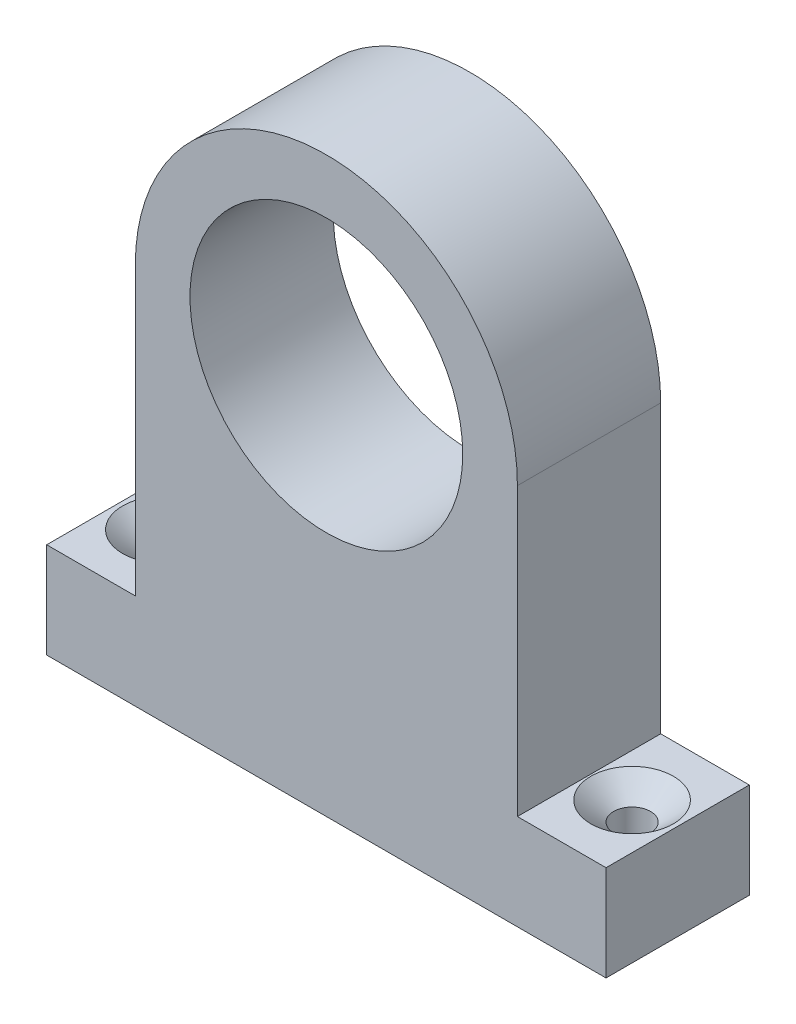
ISO-10303-21;
HEADER;
FILE_DESCRIPTION(('STEP AP214'),'2;1');
FILE_NAME('part.step','',(''),(''),'','','');
FILE_SCHEMA(('AUTOMOTIVE_DESIGN { 1 0 10303 214 1 1 1 1 }'));
ENDSEC;
DATA;
#1=APPLICATION_CONTEXT('core data for automotive mechanical design processes');
#2=APPLICATION_PROTOCOL_DEFINITION('international standard','automotive_design',2000,#1);
#3=PRODUCT_CONTEXT('',#1,'mechanical');
#4=PRODUCT('Part','Part','',(#3));
#5=PRODUCT_RELATED_PRODUCT_CATEGORY('part','',(#4));
#6=PRODUCT_DEFINITION_FORMATION('','',#4);
#7=PRODUCT_DEFINITION_CONTEXT('part definition',#1,'design');
#8=PRODUCT_DEFINITION('design','',#6,#7);
#9=PRODUCT_DEFINITION_SHAPE('','',#8);
#10=(LENGTH_UNIT() NAMED_UNIT(*) SI_UNIT(.MILLI.,.METRE.));
#11=(NAMED_UNIT(*) PLANE_ANGLE_UNIT() SI_UNIT($,.RADIAN.));
#12=(NAMED_UNIT(*) SI_UNIT($,.STERADIAN.) SOLID_ANGLE_UNIT());
#13=UNCERTAINTY_MEASURE_WITH_UNIT(LENGTH_MEASURE(1.E-05),#10,'distance_accuracy_value','');
#14=(GEOMETRIC_REPRESENTATION_CONTEXT(3) GLOBAL_UNCERTAINTY_ASSIGNED_CONTEXT((#13)) GLOBAL_UNIT_ASSIGNED_CONTEXT((#10,
#11,#12)) REPRESENTATION_CONTEXT('',''));
#15=CARTESIAN_POINT('',(0.,0.,0.));
#16=DIRECTION('',(0.,0.,1.));
#17=DIRECTION('',(1.,0.,0.));
#18=AXIS2_PLACEMENT_3D('',#15,#16,#17);
#19=CARTESIAN_POINT('',(-37.1816,95.25,97.5106));
#20=DIRECTION('',(0.,0.,-1.));
#21=DIRECTION('',(-1.,0.,0.));
#22=AXIS2_PLACEMENT_3D('',#19,#20,#21);
#23=PLANE('',#22);
#24=CARTESIAN_POINT('',(0.,69.8500000000001,97.5106));
#25=DIRECTION('',(0.,0.,1.));
#26=DIRECTION('',(1.,0.,0.));
#27=AXIS2_PLACEMENT_3D('',#24,#25,#26);
#28=CIRCLE('',#27,18.1316);
#29=CARTESIAN_POINT('',(18.1316000000001,69.8500000000001,97.5106));
#30=VERTEX_POINT('',#29);
#31=EDGE_CURVE('E197',#30,#30,#28,.T.);
#32=ORIENTED_EDGE('',*,*,#31,.F.);
#33=EDGE_LOOP('',(#32));
#34=FACE_BOUND('',#33,.T.);
#35=CARTESIAN_POINT('',(0.,69.8500000000001,97.5106));
#36=DIRECTION('',(0.,0.,1.));
#37=DIRECTION('',(1.,0.,0.));
#38=AXIS2_PLACEMENT_3D('',#35,#36,#37);
#39=CIRCLE('',#38,25.3999999999999);
#40=CARTESIAN_POINT('',(25.3999999999999,69.8500000000002,97.5106));
#41=VERTEX_POINT('',#40);
#42=CARTESIAN_POINT('',(-25.3999999999998,69.8500000000001,97.5106));
#43=VERTEX_POINT('',#42);
#44=EDGE_CURVE('E173',#41,#43,#39,.T.);
#45=ORIENTED_EDGE('',*,*,#44,.T.);
#46=DIRECTION('',(0.,-1.,0.));
#47=VECTOR('',#46,1.);
#48=CARTESIAN_POINT('',(-25.3999999999998,0.,97.5106));
#49=LINE('',#48,#47);
#50=CARTESIAN_POINT('',(-25.3999999999998,31.75,97.5106));
#51=VERTEX_POINT('',#50);
#52=EDGE_CURVE('E176',#43,#51,#49,.T.);
#53=ORIENTED_EDGE('',*,*,#52,.T.);
#54=DIRECTION('',(1.,0.,0.));
#55=VECTOR('',#54,1.);
#56=CARTESIAN_POINT('',(0.,31.75,97.5106));
#57=LINE('',#56,#55);
#58=CARTESIAN_POINT('',(-37.1816,31.75,97.5106));
#59=VERTEX_POINT('',#58);
#60=EDGE_CURVE('E182',#59,#51,#57,.T.);
#61=ORIENTED_EDGE('',*,*,#60,.F.);
#62=DIRECTION('',(0.,-1.,0.));
#63=VECTOR('',#62,1.);
#64=CARTESIAN_POINT('',(-37.1816,95.25,97.5106));
#65=LINE('',#64,#63);
#66=CARTESIAN_POINT('',(-37.1816,19.05,97.5106));
#67=VERTEX_POINT('',#66);
#68=EDGE_CURVE('E12',#59,#67,#65,.T.);
#69=ORIENTED_EDGE('',*,*,#68,.T.);
#70=DIRECTION('',(1.,0.,0.));
#71=VECTOR('',#70,1.);
#72=CARTESIAN_POINT('',(-37.1816,19.05,97.5106));
#73=LINE('',#72,#71);
#74=CARTESIAN_POINT('',(37.1816000000001,19.05,97.5106));
#75=VERTEX_POINT('',#74);
#76=EDGE_CURVE('E229',#67,#75,#73,.T.);
#77=ORIENTED_EDGE('',*,*,#76,.T.);
#78=DIRECTION('',(0.,-1.,0.));
#79=VECTOR('',#78,1.);
#80=CARTESIAN_POINT('',(37.1816000000001,95.25,97.5106));
#81=LINE('',#80,#79);
#82=CARTESIAN_POINT('',(37.1816000000001,31.75,97.5106));
#83=VERTEX_POINT('',#82);
#84=EDGE_CURVE('E113',#83,#75,#81,.T.);
#85=ORIENTED_EDGE('',*,*,#84,.F.);
#86=DIRECTION('',(1.,0.,0.));
#87=VECTOR('',#86,1.);
#88=CARTESIAN_POINT('',(0.,31.75,97.5106));
#89=LINE('',#88,#87);
#90=CARTESIAN_POINT('',(25.3999999999999,31.75,97.5106));
#91=VERTEX_POINT('',#90);
#92=EDGE_CURVE('E213',#91,#83,#89,.T.);
#93=ORIENTED_EDGE('',*,*,#92,.F.);
#94=DIRECTION('',(0.,-1.,0.));
#95=VECTOR('',#94,1.);
#96=CARTESIAN_POINT('',(25.3999999999997,-1.08709337827878E-13,97.5106));
#97=LINE('',#96,#95);
#98=EDGE_CURVE('E179',#41,#91,#97,.T.);
#99=ORIENTED_EDGE('',*,*,#98,.F.);
#100=EDGE_LOOP('',(#45,#53,#61,#69,#77,#85,#93,#99));
#101=FACE_BOUND('',#100,.T.);
#102=ADVANCED_FACE('F105',(#34,#101),#23,.F.);
#103=CARTESIAN_POINT('',(-37.1816,95.25,78.4606));
#104=DIRECTION('',(0.,0.,1.));
#105=DIRECTION('',(1.,0.,0.));
#106=AXIS2_PLACEMENT_3D('',#103,#104,#105);
#107=PLANE('',#106);
#108=CARTESIAN_POINT('',(0.,69.8500000000001,78.4606));
#109=DIRECTION('',(0.,0.,1.));
#110=DIRECTION('',(1.,0.,0.));
#111=AXIS2_PLACEMENT_3D('',#108,#109,#110);
#112=CIRCLE('',#111,18.1316);
#113=CARTESIAN_POINT('',(18.1316000000001,69.8500000000001,78.4606));
#114=VERTEX_POINT('',#113);
#115=EDGE_CURVE('E202',#114,#114,#112,.T.);
#116=ORIENTED_EDGE('',*,*,#115,.T.);
#117=EDGE_LOOP('',(#116));
#118=FACE_BOUND('',#117,.T.);
#119=DIRECTION('',(0.,-1.,0.));
#120=VECTOR('',#119,1.);
#121=CARTESIAN_POINT('',(-25.3999999999998,0.,78.4606));
#122=LINE('',#121,#120);
#123=CARTESIAN_POINT('',(-25.3999999999998,69.8500000000001,78.4606));
#124=VERTEX_POINT('',#123);
#125=CARTESIAN_POINT('',(-25.3999999999998,31.75,78.4606));
#126=VERTEX_POINT('',#125);
#127=EDGE_CURVE('E207',#124,#126,#122,.T.);
#128=ORIENTED_EDGE('',*,*,#127,.F.);
#129=CARTESIAN_POINT('',(0.,69.8500000000001,78.4606));
#130=DIRECTION('',(0.,0.,1.));
#131=DIRECTION('',(1.,0.,0.));
#132=AXIS2_PLACEMENT_3D('',#129,#130,#131);
#133=CIRCLE('',#132,25.3999999999999);
#134=CARTESIAN_POINT('',(25.3999999999999,69.8500000000002,78.4606));
#135=VERTEX_POINT('',#134);
#136=EDGE_CURVE('E196',#135,#124,#133,.T.);
#137=ORIENTED_EDGE('',*,*,#136,.F.);
#138=DIRECTION('',(0.,-1.,0.));
#139=VECTOR('',#138,1.);
#140=CARTESIAN_POINT('',(25.3999999999997,-1.08709337827878E-13,78.4606));
#141=LINE('',#140,#139);
#142=CARTESIAN_POINT('',(25.3999999999999,31.75,78.4606));
#143=VERTEX_POINT('',#142);
#144=EDGE_CURVE('E212',#135,#143,#141,.T.);
#145=ORIENTED_EDGE('',*,*,#144,.T.);
#146=DIRECTION('',(1.,0.,0.));
#147=VECTOR('',#146,1.);
#148=CARTESIAN_POINT('',(0.,31.75,78.4606));
#149=LINE('',#148,#147);
#150=CARTESIAN_POINT('',(37.1816000000001,31.75,78.4606));
#151=VERTEX_POINT('',#150);
#152=EDGE_CURVE('E216',#143,#151,#149,.T.);
#153=ORIENTED_EDGE('',*,*,#152,.T.);
#154=DIRECTION('',(0.,-1.,0.));
#155=VECTOR('',#154,1.);
#156=CARTESIAN_POINT('',(37.1816000000001,95.25,78.4606));
#157=LINE('',#156,#155);
#158=CARTESIAN_POINT('',(37.1816000000001,19.05,78.4606));
#159=VERTEX_POINT('',#158);
#160=EDGE_CURVE('E127',#151,#159,#157,.T.);
#161=ORIENTED_EDGE('',*,*,#160,.T.);
#162=DIRECTION('',(-1.,0.,0.));
#163=VECTOR('',#162,1.);
#164=CARTESIAN_POINT('',(-37.1816,19.05,78.4606));
#165=LINE('',#164,#163);
#166=CARTESIAN_POINT('',(-37.1816,19.05,78.4606));
#167=VERTEX_POINT('',#166);
#168=EDGE_CURVE('E234',#159,#167,#165,.T.);
#169=ORIENTED_EDGE('',*,*,#168,.T.);
#170=DIRECTION('',(0.,-1.,0.));
#171=VECTOR('',#170,1.);
#172=CARTESIAN_POINT('',(-37.1816,95.25,78.4606));
#173=LINE('',#172,#171);
#174=CARTESIAN_POINT('',(-37.1816,31.75,78.4606));
#175=VERTEX_POINT('',#174);
#176=EDGE_CURVE('E120',#175,#167,#173,.T.);
#177=ORIENTED_EDGE('',*,*,#176,.F.);
#178=DIRECTION('',(1.,0.,0.));
#179=VECTOR('',#178,1.);
#180=CARTESIAN_POINT('',(0.,31.75,78.4606));
#181=LINE('',#180,#179);
#182=EDGE_CURVE('E192',#175,#126,#181,.T.);
#183=ORIENTED_EDGE('',*,*,#182,.T.);
#184=EDGE_LOOP('',(#128,#137,#145,#153,#161,#169,#177,#183));
#185=FACE_BOUND('',#184,.T.);
#186=ADVANCED_FACE('F247',(#118,#185),#107,.F.);
#187=CARTESIAN_POINT('',(-37.1816,95.25,78.4606));
#188=DIRECTION('',(1.,0.,0.));
#189=DIRECTION('',(0.,0.,-1.));
#190=AXIS2_PLACEMENT_3D('',#187,#188,#189);
#191=PLANE('',#190);
#192=ORIENTED_EDGE('',*,*,#68,.F.);
#193=DIRECTION('',(0.,0.,1.));
#194=VECTOR('',#193,1.);
#195=CARTESIAN_POINT('',(-37.1816,31.75,78.4606));
#196=LINE('',#195,#194);
#197=EDGE_CURVE('E199',#175,#59,#196,.T.);
#198=ORIENTED_EDGE('',*,*,#197,.F.);
#199=ORIENTED_EDGE('',*,*,#176,.T.);
#200=DIRECTION('',(0.,0.,1.));
#201=VECTOR('',#200,1.);
#202=CARTESIAN_POINT('',(-37.1816,19.05,78.4606));
#203=LINE('',#202,#201);
#204=EDGE_CURVE('E224',#167,#67,#203,.T.);
#205=ORIENTED_EDGE('',*,*,#204,.T.);
#206=EDGE_LOOP('',(#192,#198,#199,#205));
#207=FACE_BOUND('',#206,.T.);
#208=ADVANCED_FACE('F107',(#207),#191,.F.);
#209=CARTESIAN_POINT('',(37.1816000000001,95.25,78.4606));
#210=DIRECTION('',(-1.,0.,0.));
#211=DIRECTION('',(0.,0.,1.));
#212=AXIS2_PLACEMENT_3D('',#209,#210,#211);
#213=PLANE('',#212);
#214=ORIENTED_EDGE('',*,*,#160,.F.);
#215=DIRECTION('',(0.,0.,1.));
#216=VECTOR('',#215,1.);
#217=CARTESIAN_POINT('',(37.1816000000001,31.75,78.4606));
#218=LINE('',#217,#216);
#219=EDGE_CURVE('E221',#151,#83,#218,.T.);
#220=ORIENTED_EDGE('',*,*,#219,.T.);
#221=ORIENTED_EDGE('',*,*,#84,.T.);
#222=DIRECTION('',(0.,0.,-1.));
#223=VECTOR('',#222,1.);
#224=CARTESIAN_POINT('',(37.1816000000001,19.05,78.4606));
#225=LINE('',#224,#223);
#226=EDGE_CURVE('E232',#75,#159,#225,.T.);
#227=ORIENTED_EDGE('',*,*,#226,.T.);
#228=EDGE_LOOP('',(#214,#220,#221,#227));
#229=FACE_BOUND('',#228,.T.);
#230=ADVANCED_FACE('F239',(#229),#213,.F.);
#231=CARTESIAN_POINT('',(0.,19.05,0.));
#232=DIRECTION('',(0.,1.,0.));
#233=DIRECTION('',(0.,0.,1.));
#234=AXIS2_PLACEMENT_3D('',#231,#232,#233);
#235=PLANE('',#234);
#236=CARTESIAN_POINT('',(-31.1249999999999,19.05,87.9856));
#237=DIRECTION('',(0.,1.,0.));
#238=DIRECTION('',(0.,0.,1.));
#239=AXIS2_PLACEMENT_3D('',#236,#237,#238);
#240=CIRCLE('',#239,2.45744999999999);
#241=CARTESIAN_POINT('',(-31.1249999999999,19.05,90.44305));
#242=VERTEX_POINT('',#241);
#243=EDGE_CURVE('E262',#242,#242,#240,.T.);
#244=ORIENTED_EDGE('',*,*,#243,.T.);
#245=EDGE_LOOP('',(#244));
#246=FACE_BOUND('',#245,.T.);
#247=CARTESIAN_POINT('',(31.125,19.05,87.9856));
#248=DIRECTION('',(0.,1.,0.));
#249=DIRECTION('',(0.,0.,1.));
#250=AXIS2_PLACEMENT_3D('',#247,#248,#249);
#251=CIRCLE('',#250,2.45744999999999);
#252=CARTESIAN_POINT('',(31.125,19.05,90.44305));
#253=VERTEX_POINT('',#252);
#254=EDGE_CURVE('E252',#253,#253,#251,.T.);
#255=ORIENTED_EDGE('',*,*,#254,.T.);
#256=EDGE_LOOP('',(#255));
#257=FACE_BOUND('',#256,.T.);
#258=ORIENTED_EDGE('',*,*,#204,.F.);
#259=ORIENTED_EDGE('',*,*,#168,.F.);
#260=ORIENTED_EDGE('',*,*,#226,.F.);
#261=ORIENTED_EDGE('',*,*,#76,.F.);
#262=EDGE_LOOP('',(#258,#259,#260,#261));
#263=FACE_BOUND('',#262,.T.);
#264=ADVANCED_FACE('F246',(#246,#257,#263),#235,.F.);
#265=CARTESIAN_POINT('',(0.,69.8500000000001,78.4606));
#266=DIRECTION('',(0.,0.,1.));
#267=DIRECTION('',(1.,0.,0.));
#268=AXIS2_PLACEMENT_3D('',#265,#266,#267);
#269=CYLINDRICAL_SURFACE('',#268,25.3999999999999);
#270=ORIENTED_EDGE('',*,*,#44,.F.);
#271=DIRECTION('',(0.,0.,1.));
#272=VECTOR('',#271,1.);
#273=CARTESIAN_POINT('',(25.3999999999999,69.8500000000002,78.4606));
#274=LINE('',#273,#272);
#275=EDGE_CURVE('E217',#135,#41,#274,.T.);
#276=ORIENTED_EDGE('',*,*,#275,.F.);
#277=ORIENTED_EDGE('',*,*,#136,.T.);
#278=DIRECTION('',(0.,0.,1.));
#279=VECTOR('',#278,1.);
#280=CARTESIAN_POINT('',(-25.3999999999998,69.8500000000001,78.4606));
#281=LINE('',#280,#279);
#282=EDGE_CURVE('E187',#124,#43,#281,.T.);
#283=ORIENTED_EDGE('',*,*,#282,.T.);
#284=EDGE_LOOP('',(#270,#276,#277,#283));
#285=FACE_BOUND('',#284,.T.);
#286=ADVANCED_FACE('F194',(#285),#269,.T.);
#287=CARTESIAN_POINT('',(0.,31.75,78.4606));
#288=DIRECTION('',(0.,-1.,0.));
#289=DIRECTION('',(0.,0.,-1.));
#290=AXIS2_PLACEMENT_3D('',#287,#288,#289);
#291=PLANE('',#290);
#292=CARTESIAN_POINT('',(31.125,31.75,87.9856));
#293=DIRECTION('',(0.,1.,0.));
#294=DIRECTION('',(0.,0.,1.));
#295=AXIS2_PLACEMENT_3D('',#292,#293,#294);
#296=CIRCLE('',#295,5.4864);
#297=CARTESIAN_POINT('',(31.125,31.75,93.472));
#298=VERTEX_POINT('',#297);
#299=EDGE_CURVE('E259',#298,#298,#296,.T.);
#300=ORIENTED_EDGE('',*,*,#299,.F.);
#301=EDGE_LOOP('',(#300));
#302=FACE_BOUND('',#301,.T.);
#303=ORIENTED_EDGE('',*,*,#92,.T.);
#304=ORIENTED_EDGE('',*,*,#219,.F.);
#305=ORIENTED_EDGE('',*,*,#152,.F.);
#306=DIRECTION('',(0.,0.,1.));
#307=VECTOR('',#306,1.);
#308=CARTESIAN_POINT('',(25.3999999999999,31.75,78.4606));
#309=LINE('',#308,#307);
#310=EDGE_CURVE('E225',#143,#91,#309,.T.);
#311=ORIENTED_EDGE('',*,*,#310,.T.);
#312=EDGE_LOOP('',(#303,#304,#305,#311));
#313=FACE_BOUND('',#312,.T.);
#314=ADVANCED_FACE('F302',(#302,#313),#291,.F.);
#315=CARTESIAN_POINT('',(25.3999999999997,-1.08709337827878E-13,78.4606));
#316=DIRECTION('',(-1.,0.,0.));
#317=DIRECTION('',(0.,-1.,0.));
#318=AXIS2_PLACEMENT_3D('',#315,#316,#317);
#319=PLANE('',#318);
#320=ORIENTED_EDGE('',*,*,#98,.T.);
#321=ORIENTED_EDGE('',*,*,#310,.F.);
#322=ORIENTED_EDGE('',*,*,#144,.F.);
#323=ORIENTED_EDGE('',*,*,#275,.T.);
#324=EDGE_LOOP('',(#320,#321,#322,#323));
#325=FACE_BOUND('',#324,.T.);
#326=ADVANCED_FACE('F284',(#325),#319,.F.);
#327=CARTESIAN_POINT('',(-25.3999999999998,0.,78.4606));
#328=DIRECTION('',(-1.,0.,0.));
#329=DIRECTION('',(0.,-1.,0.));
#330=AXIS2_PLACEMENT_3D('',#327,#328,#329);
#331=PLANE('',#330);
#332=ORIENTED_EDGE('',*,*,#52,.F.);
#333=ORIENTED_EDGE('',*,*,#282,.F.);
#334=ORIENTED_EDGE('',*,*,#127,.T.);
#335=DIRECTION('',(0.,0.,1.));
#336=VECTOR('',#335,1.);
#337=CARTESIAN_POINT('',(-25.3999999999998,31.75,78.4606));
#338=LINE('',#337,#336);
#339=EDGE_CURVE('E190',#126,#51,#338,.T.);
#340=ORIENTED_EDGE('',*,*,#339,.T.);
#341=EDGE_LOOP('',(#332,#333,#334,#340));
#342=FACE_BOUND('',#341,.T.);
#343=ADVANCED_FACE('F186',(#342),#331,.T.);
#344=CARTESIAN_POINT('',(0.,31.75,78.4606));
#345=DIRECTION('',(0.,-1.,0.));
#346=DIRECTION('',(0.,0.,-1.));
#347=AXIS2_PLACEMENT_3D('',#344,#345,#346);
#348=PLANE('',#347);
#349=CARTESIAN_POINT('',(-31.1249999999999,31.75,87.9856));
#350=DIRECTION('',(0.,1.,0.));
#351=DIRECTION('',(0.,0.,1.));
#352=AXIS2_PLACEMENT_3D('',#349,#350,#351);
#353=CIRCLE('',#352,5.4864);
#354=CARTESIAN_POINT('',(-31.1249999999999,31.75,93.472));
#355=VERTEX_POINT('',#354);
#356=EDGE_CURVE('E268',#355,#355,#353,.T.);
#357=ORIENTED_EDGE('',*,*,#356,.F.);
#358=EDGE_LOOP('',(#357));
#359=FACE_BOUND('',#358,.T.);
#360=ORIENTED_EDGE('',*,*,#60,.T.);
#361=ORIENTED_EDGE('',*,*,#339,.F.);
#362=ORIENTED_EDGE('',*,*,#182,.F.);
#363=ORIENTED_EDGE('',*,*,#197,.T.);
#364=EDGE_LOOP('',(#360,#361,#362,#363));
#365=FACE_BOUND('',#364,.T.);
#366=ADVANCED_FACE('F249',(#359,#365),#348,.F.);
#367=CARTESIAN_POINT('',(0.,69.8500000000001,78.4606));
#368=DIRECTION('',(0.,0.,1.));
#369=DIRECTION('',(1.,0.,0.));
#370=AXIS2_PLACEMENT_3D('',#367,#368,#369);
#371=CYLINDRICAL_SURFACE('',#370,18.1316);
#372=ORIENTED_EDGE('',*,*,#115,.F.);
#373=EDGE_LOOP('',(#372));
#374=FACE_BOUND('',#373,.T.);
#375=ORIENTED_EDGE('',*,*,#31,.T.);
#376=EDGE_LOOP('',(#375));
#377=FACE_BOUND('',#376,.T.);
#378=ADVANCED_FACE('F275',(#374,#377),#371,.F.);
#379=CARTESIAN_POINT('',(31.125,31.75,87.9856));
#380=DIRECTION('',(0.,1.,0.));
#381=DIRECTION('',(0.,0.,1.));
#382=AXIS2_PLACEMENT_3D('',#379,#380,#381);
#383=CYLINDRICAL_SURFACE('',#382,2.45744999999999);
#384=ORIENTED_EDGE('',*,*,#254,.F.);
#385=EDGE_LOOP('',(#384));
#386=FACE_BOUND('',#385,.T.);
#387=CARTESIAN_POINT('',(31.125,29.2084091721456,87.9856));
#388=DIRECTION('',(0.,1.,0.));
#389=DIRECTION('',(0.,0.,1.));
#390=AXIS2_PLACEMENT_3D('',#387,#388,#389);
#391=CIRCLE('',#390,2.45744999999999);
#392=CARTESIAN_POINT('',(31.125,29.2084091721456,90.44305));
#393=VERTEX_POINT('',#392);
#394=EDGE_CURVE('E256',#393,#393,#391,.T.);
#395=ORIENTED_EDGE('',*,*,#394,.T.);
#396=EDGE_LOOP('',(#395));
#397=FACE_BOUND('',#396,.T.);
#398=ADVANCED_FACE('F281',(#386,#397),#383,.F.);
#399=CARTESIAN_POINT('',(31.125,31.75,87.9856));
#400=DIRECTION('',(0.,1.,0.));
#401=DIRECTION('',(0.,0.,1.));
#402=AXIS2_PLACEMENT_3D('',#399,#400,#401);
#403=CONICAL_SURFACE('',#402,5.4864,0.872664625997168);
#404=ORIENTED_EDGE('',*,*,#394,.F.);
#405=EDGE_LOOP('',(#404));
#406=FACE_BOUND('',#405,.T.);
#407=ORIENTED_EDGE('',*,*,#299,.T.);
#408=EDGE_LOOP('',(#407));
#409=FACE_BOUND('',#408,.T.);
#410=ADVANCED_FACE('F315',(#406,#409),#403,.F.);
#411=CARTESIAN_POINT('',(-31.1249999999999,31.75,87.9856));
#412=DIRECTION('',(0.,1.,0.));
#413=DIRECTION('',(0.,0.,1.));
#414=AXIS2_PLACEMENT_3D('',#411,#412,#413);
#415=CYLINDRICAL_SURFACE('',#414,2.45744999999999);
#416=ORIENTED_EDGE('',*,*,#243,.F.);
#417=EDGE_LOOP('',(#416));
#418=FACE_BOUND('',#417,.T.);
#419=CARTESIAN_POINT('',(-31.1249999999999,29.2084091721456,87.9856));
#420=DIRECTION('',(0.,1.,0.));
#421=DIRECTION('',(0.,0.,1.));
#422=AXIS2_PLACEMENT_3D('',#419,#420,#421);
#423=CIRCLE('',#422,2.45744999999999);
#424=CARTESIAN_POINT('',(-31.1249999999999,29.2084091721456,90.44305));
#425=VERTEX_POINT('',#424);
#426=EDGE_CURVE('E265',#425,#425,#423,.T.);
#427=ORIENTED_EDGE('',*,*,#426,.T.);
#428=EDGE_LOOP('',(#427));
#429=FACE_BOUND('',#428,.T.);
#430=ADVANCED_FACE('F317',(#418,#429),#415,.F.);
#431=CARTESIAN_POINT('',(-31.1249999999999,31.75,87.9856));
#432=DIRECTION('',(0.,1.,0.));
#433=DIRECTION('',(0.,0.,1.));
#434=AXIS2_PLACEMENT_3D('',#431,#432,#433);
#435=CONICAL_SURFACE('',#434,5.4864,0.872664625997167);
#436=ORIENTED_EDGE('',*,*,#426,.F.);
#437=EDGE_LOOP('',(#436));
#438=FACE_BOUND('',#437,.T.);
#439=ORIENTED_EDGE('',*,*,#356,.T.);
#440=EDGE_LOOP('',(#439));
#441=FACE_BOUND('',#440,.T.);
#442=ADVANCED_FACE('F272',(#438,#441),#435,.F.);
#443=CLOSED_SHELL('',(#102,#186,#208,#230,#264,#286,#314,#326,#343,#366,#378,#398,#410,#430,#442));
#444=MANIFOLD_SOLID_BREP('B2',#443);
#445=ADVANCED_BREP_SHAPE_REPRESENTATION('',(#18,#444),#14);
#446=SHAPE_DEFINITION_REPRESENTATION(#9,#445);
ENDSEC;
END-ISO-10303-21;
